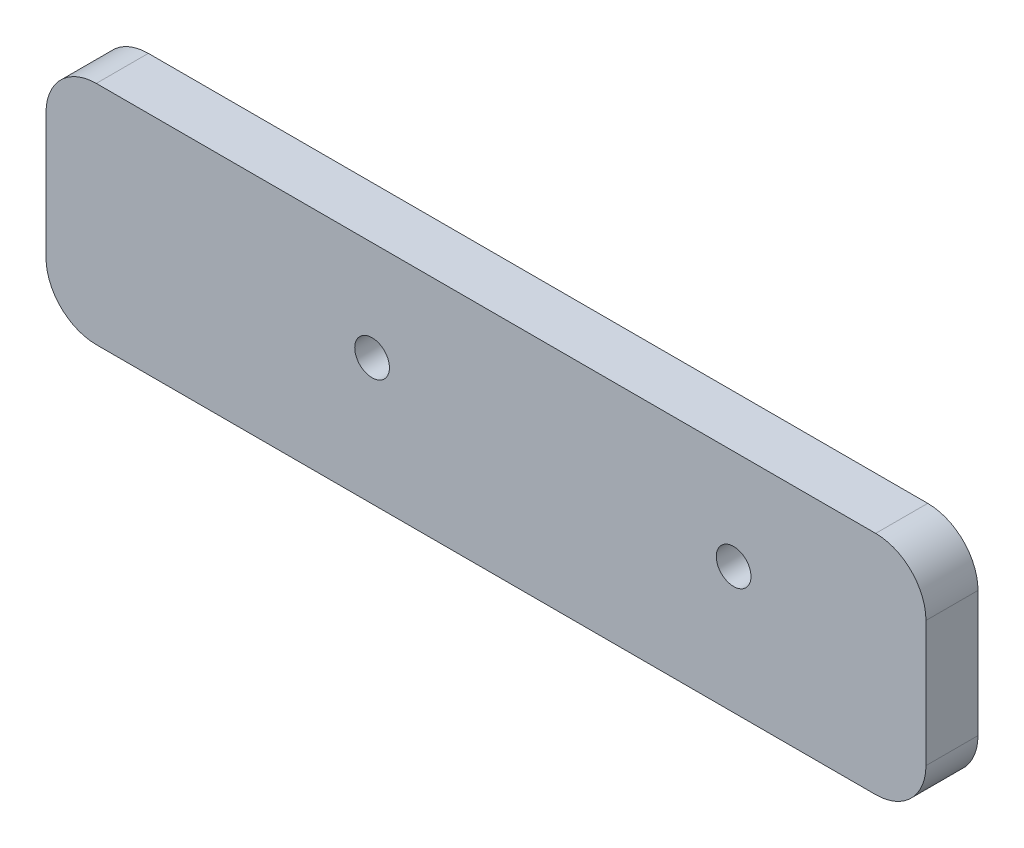
ISO-10303-21;
HEADER;
FILE_DESCRIPTION(('STEP AP214'),'2;1');
FILE_NAME('part.step','',(''),(''),'','','');
FILE_SCHEMA(('AUTOMOTIVE_DESIGN { 1 0 10303 214 1 1 1 1 }'));
ENDSEC;
DATA;
#1=APPLICATION_CONTEXT('core data for automotive mechanical design processes');
#2=APPLICATION_PROTOCOL_DEFINITION('international standard','automotive_design',2000,#1);
#3=PRODUCT_CONTEXT('',#1,'mechanical');
#4=PRODUCT('Part','Part','',(#3));
#5=PRODUCT_RELATED_PRODUCT_CATEGORY('part','',(#4));
#6=PRODUCT_DEFINITION_FORMATION('','',#4);
#7=PRODUCT_DEFINITION_CONTEXT('part definition',#1,'design');
#8=PRODUCT_DEFINITION('design','',#6,#7);
#9=PRODUCT_DEFINITION_SHAPE('','',#8);
#10=(LENGTH_UNIT() NAMED_UNIT(*) SI_UNIT(.MILLI.,.METRE.));
#11=(NAMED_UNIT(*) PLANE_ANGLE_UNIT() SI_UNIT($,.RADIAN.));
#12=(NAMED_UNIT(*) SI_UNIT($,.STERADIAN.) SOLID_ANGLE_UNIT());
#13=UNCERTAINTY_MEASURE_WITH_UNIT(LENGTH_MEASURE(1.E-05),#10,'distance_accuracy_value','');
#14=(GEOMETRIC_REPRESENTATION_CONTEXT(3) GLOBAL_UNCERTAINTY_ASSIGNED_CONTEXT((#13)) GLOBAL_UNIT_ASSIGNED_CONTEXT((#10,
#11,#12)) REPRESENTATION_CONTEXT('',''));
#15=CARTESIAN_POINT('',(0.,0.,0.));
#16=DIRECTION('',(0.,0.,1.));
#17=DIRECTION('',(1.,0.,0.));
#18=AXIS2_PLACEMENT_3D('',#15,#16,#17);
#19=CARTESIAN_POINT('',(-39.37,-6.35,5.2578));
#20=DIRECTION('',(0.,0.,1.));
#21=DIRECTION('',(1.,0.,0.));
#22=AXIS2_PLACEMENT_3D('',#19,#20,#21);
#23=CYLINDRICAL_SURFACE('',#22,5.08);
#24=DIRECTION('',(0.,0.,1.));
#25=VECTOR('',#24,1.);
#26=CARTESIAN_POINT('',(-44.45,-6.35,5.2578));
#27=LINE('',#26,#25);
#28=CARTESIAN_POINT('',(-44.45,-6.35,0.));
#29=VERTEX_POINT('',#28);
#30=CARTESIAN_POINT('',(-44.45,-6.35,5.2578));
#31=VERTEX_POINT('',#30);
#32=EDGE_CURVE('E152',#29,#31,#27,.T.);
#33=ORIENTED_EDGE('',*,*,#32,.F.);
#34=CARTESIAN_POINT('',(-39.37,-6.35,0.));
#35=DIRECTION('',(0.,0.,-1.));
#36=DIRECTION('',(-1.,0.,0.));
#37=AXIS2_PLACEMENT_3D('',#34,#35,#36);
#38=CIRCLE('',#37,5.08);
#39=CARTESIAN_POINT('',(-39.37,-11.43,0.));
#40=VERTEX_POINT('',#39);
#41=EDGE_CURVE('E41',#40,#29,#38,.T.);
#42=ORIENTED_EDGE('',*,*,#41,.F.);
#43=DIRECTION('',(0.,0.,1.));
#44=VECTOR('',#43,1.);
#45=CARTESIAN_POINT('',(-39.37,-11.43,5.2578));
#46=LINE('',#45,#44);
#47=CARTESIAN_POINT('',(-39.37,-11.43,5.2578));
#48=VERTEX_POINT('',#47);
#49=EDGE_CURVE('E155',#48,#40,#46,.F.);
#50=ORIENTED_EDGE('',*,*,#49,.F.);
#51=CARTESIAN_POINT('',(-39.37,-6.35,5.2578));
#52=DIRECTION('',(0.,0.,-1.));
#53=DIRECTION('',(-1.,0.,0.));
#54=AXIS2_PLACEMENT_3D('',#51,#52,#53);
#55=CIRCLE('',#54,5.08);
#56=EDGE_CURVE('E11',#31,#48,#55,.F.);
#57=ORIENTED_EDGE('',*,*,#56,.F.);
#58=EDGE_LOOP('',(#33,#42,#50,#57));
#59=FACE_BOUND('',#58,.T.);
#60=ADVANCED_FACE('F33',(#59),#23,.T.);
#61=CARTESIAN_POINT('',(39.37,-6.35,5.2578));
#62=DIRECTION('',(0.,0.,-1.));
#63=DIRECTION('',(-1.,0.,0.));
#64=AXIS2_PLACEMENT_3D('',#61,#62,#63);
#65=CYLINDRICAL_SURFACE('',#64,5.08);
#66=DIRECTION('',(0.,0.,-1.));
#67=VECTOR('',#66,1.);
#68=CARTESIAN_POINT('',(44.45,-6.35,5.2578));
#69=LINE('',#68,#67);
#70=CARTESIAN_POINT('',(44.45,-6.35,5.2578));
#71=VERTEX_POINT('',#70);
#72=CARTESIAN_POINT('',(44.45,-6.35,0.));
#73=VERTEX_POINT('',#72);
#74=EDGE_CURVE('E141',#71,#73,#69,.T.);
#75=ORIENTED_EDGE('',*,*,#74,.F.);
#76=CARTESIAN_POINT('',(39.37,-6.35,5.2578));
#77=DIRECTION('',(0.,0.,-1.));
#78=DIRECTION('',(-1.,0.,0.));
#79=AXIS2_PLACEMENT_3D('',#76,#77,#78);
#80=CIRCLE('',#79,5.08);
#81=CARTESIAN_POINT('',(39.37,-11.43,5.2578));
#82=VERTEX_POINT('',#81);
#83=EDGE_CURVE('E147',#82,#71,#80,.F.);
#84=ORIENTED_EDGE('',*,*,#83,.F.);
#85=DIRECTION('',(0.,0.,-1.));
#86=VECTOR('',#85,1.);
#87=CARTESIAN_POINT('',(39.37,-11.43,5.2578));
#88=LINE('',#87,#86);
#89=CARTESIAN_POINT('',(39.37,-11.43,0.));
#90=VERTEX_POINT('',#89);
#91=EDGE_CURVE('E144',#90,#82,#88,.F.);
#92=ORIENTED_EDGE('',*,*,#91,.F.);
#93=CARTESIAN_POINT('',(39.37,-6.35,0.));
#94=DIRECTION('',(0.,0.,-1.));
#95=DIRECTION('',(-1.,0.,0.));
#96=AXIS2_PLACEMENT_3D('',#93,#94,#95);
#97=CIRCLE('',#96,5.08);
#98=EDGE_CURVE('E149',#73,#90,#97,.T.);
#99=ORIENTED_EDGE('',*,*,#98,.F.);
#100=EDGE_LOOP('',(#75,#84,#92,#99));
#101=FACE_BOUND('',#100,.T.);
#102=ADVANCED_FACE('F184',(#101),#65,.T.);
#103=CARTESIAN_POINT('',(39.37,6.35,5.2578));
#104=DIRECTION('',(0.,0.,-1.));
#105=DIRECTION('',(-1.,0.,0.));
#106=AXIS2_PLACEMENT_3D('',#103,#104,#105);
#107=CYLINDRICAL_SURFACE('',#106,5.08);
#108=DIRECTION('',(0.,0.,-1.));
#109=VECTOR('',#108,1.);
#110=CARTESIAN_POINT('',(39.37,11.43,5.2578));
#111=LINE('',#110,#109);
#112=CARTESIAN_POINT('',(39.37,11.43,5.2578));
#113=VERTEX_POINT('',#112);
#114=CARTESIAN_POINT('',(39.37,11.43,0.));
#115=VERTEX_POINT('',#114);
#116=EDGE_CURVE('E104',#113,#115,#111,.T.);
#117=ORIENTED_EDGE('',*,*,#116,.F.);
#118=CARTESIAN_POINT('',(39.37,6.35,5.2578));
#119=DIRECTION('',(0.,0.,-1.));
#120=DIRECTION('',(-1.,0.,0.));
#121=AXIS2_PLACEMENT_3D('',#118,#119,#120);
#122=CIRCLE('',#121,5.08);
#123=CARTESIAN_POINT('',(44.45,6.35,5.2578));
#124=VERTEX_POINT('',#123);
#125=EDGE_CURVE('E137',#124,#113,#122,.F.);
#126=ORIENTED_EDGE('',*,*,#125,.F.);
#127=DIRECTION('',(0.,0.,-1.));
#128=VECTOR('',#127,1.);
#129=CARTESIAN_POINT('',(44.45,6.35,5.2578));
#130=LINE('',#129,#128);
#131=CARTESIAN_POINT('',(44.45,6.35,0.));
#132=VERTEX_POINT('',#131);
#133=EDGE_CURVE('E134',#132,#124,#130,.F.);
#134=ORIENTED_EDGE('',*,*,#133,.F.);
#135=CARTESIAN_POINT('',(39.37,6.35,0.));
#136=DIRECTION('',(0.,0.,-1.));
#137=DIRECTION('',(-1.,0.,0.));
#138=AXIS2_PLACEMENT_3D('',#135,#136,#137);
#139=CIRCLE('',#138,5.08);
#140=EDGE_CURVE('E139',#115,#132,#139,.T.);
#141=ORIENTED_EDGE('',*,*,#140,.F.);
#142=EDGE_LOOP('',(#117,#126,#134,#141));
#143=FACE_BOUND('',#142,.T.);
#144=ADVANCED_FACE('F192',(#143),#107,.T.);
#145=CARTESIAN_POINT('',(-39.37,6.35,5.2578));
#146=DIRECTION('',(0.,0.,1.));
#147=DIRECTION('',(1.,0.,0.));
#148=AXIS2_PLACEMENT_3D('',#145,#146,#147);
#149=CYLINDRICAL_SURFACE('',#148,5.08);
#150=DIRECTION('',(0.,0.,1.));
#151=VECTOR('',#150,1.);
#152=CARTESIAN_POINT('',(-39.37,11.43,5.2578));
#153=LINE('',#152,#151);
#154=CARTESIAN_POINT('',(-39.37,11.43,0.));
#155=VERTEX_POINT('',#154);
#156=CARTESIAN_POINT('',(-39.37,11.43,5.2578));
#157=VERTEX_POINT('',#156);
#158=EDGE_CURVE('E102',#155,#157,#153,.T.);
#159=ORIENTED_EDGE('',*,*,#158,.F.);
#160=CARTESIAN_POINT('',(-39.37,6.35,0.));
#161=DIRECTION('',(0.,0.,-1.));
#162=DIRECTION('',(-1.,0.,0.));
#163=AXIS2_PLACEMENT_3D('',#160,#161,#162);
#164=CIRCLE('',#163,5.08);
#165=CARTESIAN_POINT('',(-44.45,6.35,0.));
#166=VERTEX_POINT('',#165);
#167=EDGE_CURVE('E111',#166,#155,#164,.T.);
#168=ORIENTED_EDGE('',*,*,#167,.F.);
#169=DIRECTION('',(0.,0.,1.));
#170=VECTOR('',#169,1.);
#171=CARTESIAN_POINT('',(-44.45,6.35,5.2578));
#172=LINE('',#171,#170);
#173=CARTESIAN_POINT('',(-44.45,6.35,5.2578));
#174=VERTEX_POINT('',#173);
#175=EDGE_CURVE('E119',#174,#166,#172,.F.);
#176=ORIENTED_EDGE('',*,*,#175,.F.);
#177=CARTESIAN_POINT('',(-39.37,6.35,5.2578));
#178=DIRECTION('',(0.,0.,-1.));
#179=DIRECTION('',(-1.,0.,0.));
#180=AXIS2_PLACEMENT_3D('',#177,#178,#179);
#181=CIRCLE('',#180,5.08);
#182=EDGE_CURVE('E118',#157,#174,#181,.F.);
#183=ORIENTED_EDGE('',*,*,#182,.F.);
#184=EDGE_LOOP('',(#159,#168,#176,#183));
#185=FACE_BOUND('',#184,.T.);
#186=ADVANCED_FACE('F122',(#185),#149,.T.);
#187=CARTESIAN_POINT('',(44.45,-11.43,5.2578));
#188=DIRECTION('',(-1.,0.,0.));
#189=DIRECTION('',(0.,0.,1.));
#190=AXIS2_PLACEMENT_3D('',#187,#188,#189);
#191=PLANE('',#190);
#192=DIRECTION('',(0.,1.,0.));
#193=VECTOR('',#192,1.);
#194=CARTESIAN_POINT('',(44.45,-11.43,5.2578));
#195=LINE('',#194,#193);
#196=EDGE_CURVE('E171',#71,#124,#195,.T.);
#197=ORIENTED_EDGE('',*,*,#196,.F.);
#198=ORIENTED_EDGE('',*,*,#74,.T.);
#199=DIRECTION('',(0.,1.,0.));
#200=VECTOR('',#199,1.);
#201=CARTESIAN_POINT('',(44.45,-11.43,0.));
#202=LINE('',#201,#200);
#203=EDGE_CURVE('E108',#73,#132,#202,.T.);
#204=ORIENTED_EDGE('',*,*,#203,.T.);
#205=ORIENTED_EDGE('',*,*,#133,.T.);
#206=EDGE_LOOP('',(#197,#198,#204,#205));
#207=FACE_BOUND('',#206,.T.);
#208=ADVANCED_FACE('F193',(#207),#191,.F.);
#209=CARTESIAN_POINT('',(-44.45,11.43,5.2578));
#210=DIRECTION('',(0.,-1.,0.));
#211=DIRECTION('',(0.,0.,-1.));
#212=AXIS2_PLACEMENT_3D('',#209,#210,#211);
#213=PLANE('',#212);
#214=DIRECTION('',(-1.,0.,0.));
#215=VECTOR('',#214,1.);
#216=CARTESIAN_POINT('',(-44.45,11.43,5.2578));
#217=LINE('',#216,#215);
#218=EDGE_CURVE('E173',#113,#157,#217,.T.);
#219=ORIENTED_EDGE('',*,*,#218,.F.);
#220=ORIENTED_EDGE('',*,*,#116,.T.);
#221=DIRECTION('',(-1.,0.,0.));
#222=VECTOR('',#221,1.);
#223=CARTESIAN_POINT('',(-44.45,11.43,0.));
#224=LINE('',#223,#222);
#225=EDGE_CURVE('E97',#115,#155,#224,.T.);
#226=ORIENTED_EDGE('',*,*,#225,.T.);
#227=ORIENTED_EDGE('',*,*,#158,.T.);
#228=EDGE_LOOP('',(#219,#220,#226,#227));
#229=FACE_BOUND('',#228,.T.);
#230=ADVANCED_FACE('F100',(#229),#213,.F.);
#231=CARTESIAN_POINT('',(-44.45,-11.43,5.2578));
#232=DIRECTION('',(1.,0.,0.));
#233=DIRECTION('',(0.,0.,-1.));
#234=AXIS2_PLACEMENT_3D('',#231,#232,#233);
#235=PLANE('',#234);
#236=DIRECTION('',(0.,-1.,0.));
#237=VECTOR('',#236,1.);
#238=CARTESIAN_POINT('',(-44.45,-11.43,0.));
#239=LINE('',#238,#237);
#240=EDGE_CURVE('E107',#166,#29,#239,.T.);
#241=ORIENTED_EDGE('',*,*,#240,.T.);
#242=ORIENTED_EDGE('',*,*,#32,.T.);
#243=DIRECTION('',(0.,-1.,0.));
#244=VECTOR('',#243,1.);
#245=CARTESIAN_POINT('',(-44.45,-11.43,5.2578));
#246=LINE('',#245,#244);
#247=EDGE_CURVE('E126',#174,#31,#246,.T.);
#248=ORIENTED_EDGE('',*,*,#247,.F.);
#249=ORIENTED_EDGE('',*,*,#175,.T.);
#250=EDGE_LOOP('',(#241,#242,#248,#249));
#251=FACE_BOUND('',#250,.T.);
#252=ADVANCED_FACE('F200',(#251),#235,.F.);
#253=CARTESIAN_POINT('',(-44.45,-11.43,5.2578));
#254=DIRECTION('',(0.,1.,0.));
#255=DIRECTION('',(0.,0.,1.));
#256=AXIS2_PLACEMENT_3D('',#253,#254,#255);
#257=PLANE('',#256);
#258=DIRECTION('',(1.,0.,0.));
#259=VECTOR('',#258,1.);
#260=CARTESIAN_POINT('',(-44.45,-11.43,5.2578));
#261=LINE('',#260,#259);
#262=EDGE_CURVE('E123',#48,#82,#261,.T.);
#263=ORIENTED_EDGE('',*,*,#262,.F.);
#264=ORIENTED_EDGE('',*,*,#49,.T.);
#265=DIRECTION('',(1.,0.,0.));
#266=VECTOR('',#265,1.);
#267=CARTESIAN_POINT('',(-44.45,-11.43,0.));
#268=LINE('',#267,#266);
#269=EDGE_CURVE('E129',#40,#90,#268,.T.);
#270=ORIENTED_EDGE('',*,*,#269,.T.);
#271=ORIENTED_EDGE('',*,*,#91,.T.);
#272=EDGE_LOOP('',(#263,#264,#270,#271));
#273=FACE_BOUND('',#272,.T.);
#274=ADVANCED_FACE('F178',(#273),#257,.F.);
#275=CARTESIAN_POINT('',(44.45,11.43,5.2578));
#276=DIRECTION('',(0.,0.,-1.));
#277=DIRECTION('',(-1.,0.,0.));
#278=AXIS2_PLACEMENT_3D('',#275,#276,#277);
#279=PLANE('',#278);
#280=ORIENTED_EDGE('',*,*,#247,.T.);
#281=ORIENTED_EDGE('',*,*,#56,.T.);
#282=ORIENTED_EDGE('',*,*,#262,.T.);
#283=ORIENTED_EDGE('',*,*,#83,.T.);
#284=ORIENTED_EDGE('',*,*,#196,.T.);
#285=ORIENTED_EDGE('',*,*,#125,.T.);
#286=ORIENTED_EDGE('',*,*,#218,.T.);
#287=ORIENTED_EDGE('',*,*,#182,.T.);
#288=EDGE_LOOP('',(#280,#281,#282,#283,#284,#285,#286,#287));
#289=FACE_BOUND('',#288,.T.);
#290=CARTESIAN_POINT('',(25.019,1.35889999999996,5.25780000000001));
#291=DIRECTION('',(0.,0.,1.));
#292=DIRECTION('',(-0.725995793369595,-0.687699140620121,0.));
#293=AXIS2_PLACEMENT_3D('',#290,#291,#292);
#294=CIRCLE('',#293,1.7526);
#295=CARTESIAN_POINT('',(23.7466197725404,0.153638486149134,5.25780000000001));
#296=VERTEX_POINT('',#295);
#297=EDGE_CURVE('E159',#296,#296,#294,.T.);
#298=ORIENTED_EDGE('',*,*,#297,.F.);
#299=EDGE_LOOP('',(#298));
#300=FACE_BOUND('',#299,.T.);
#301=CARTESIAN_POINT('',(-11.5062,1.35889999999996,5.25780000000001));
#302=DIRECTION('',(0.,0.,1.));
#303=DIRECTION('',(0.980819416592038,0.194918629268871,0.));
#304=AXIS2_PLACEMENT_3D('',#301,#302,#303);
#305=CIRCLE('',#304,1.7526);
#306=CARTESIAN_POINT('',(-9.78721589048082,1.70051438965658,5.25780000000001));
#307=VERTEX_POINT('',#306);
#308=EDGE_CURVE('E168',#307,#307,#305,.T.);
#309=ORIENTED_EDGE('',*,*,#308,.F.);
#310=EDGE_LOOP('',(#309));
#311=FACE_BOUND('',#310,.T.);
#312=ADVANCED_FACE('F186',(#289,#300,#311),#279,.F.);
#313=CARTESIAN_POINT('',(44.45,11.43,0.));
#314=DIRECTION('',(0.,0.,-1.));
#315=DIRECTION('',(-1.,0.,0.));
#316=AXIS2_PLACEMENT_3D('',#313,#314,#315);
#317=PLANE('',#316);
#318=CARTESIAN_POINT('',(-11.5062,1.35889999999996,0.));
#319=DIRECTION('',(0.,0.,-1.));
#320=DIRECTION('',(-1.,0.,0.));
#321=AXIS2_PLACEMENT_3D('',#318,#319,#320);
#322=CIRCLE('',#321,1.7526);
#323=CARTESIAN_POINT('',(-13.2588,1.35889999999996,0.));
#324=VERTEX_POINT('',#323);
#325=EDGE_CURVE('E36',#324,#324,#322,.T.);
#326=ORIENTED_EDGE('',*,*,#325,.F.);
#327=EDGE_LOOP('',(#326));
#328=FACE_BOUND('',#327,.T.);
#329=CARTESIAN_POINT('',(25.019,1.35889999999996,0.));
#330=DIRECTION('',(0.,0.,-1.));
#331=DIRECTION('',(-1.,0.,0.));
#332=AXIS2_PLACEMENT_3D('',#329,#330,#331);
#333=CIRCLE('',#332,1.7526);
#334=CARTESIAN_POINT('',(23.2664,1.35889999999996,0.));
#335=VERTEX_POINT('',#334);
#336=EDGE_CURVE('E157',#335,#335,#333,.T.);
#337=ORIENTED_EDGE('',*,*,#336,.F.);
#338=EDGE_LOOP('',(#337));
#339=FACE_BOUND('',#338,.T.);
#340=ORIENTED_EDGE('',*,*,#269,.F.);
#341=ORIENTED_EDGE('',*,*,#41,.T.);
#342=ORIENTED_EDGE('',*,*,#240,.F.);
#343=ORIENTED_EDGE('',*,*,#167,.T.);
#344=ORIENTED_EDGE('',*,*,#225,.F.);
#345=ORIENTED_EDGE('',*,*,#140,.T.);
#346=ORIENTED_EDGE('',*,*,#203,.F.);
#347=ORIENTED_EDGE('',*,*,#98,.T.);
#348=EDGE_LOOP('',(#340,#341,#342,#343,#344,#345,#346,#347));
#349=FACE_BOUND('',#348,.T.);
#350=ADVANCED_FACE('F113',(#328,#339,#349),#317,.T.);
#351=CARTESIAN_POINT('',(25.019,1.35889999999996,33.655));
#352=DIRECTION('',(0.,0.,1.));
#353=DIRECTION('',(-0.725995793369595,-0.687699140620121,0.));
#354=AXIS2_PLACEMENT_3D('',#351,#352,#353);
#355=CYLINDRICAL_SURFACE('',#354,1.7526);
#356=ORIENTED_EDGE('',*,*,#336,.T.);
#357=EDGE_LOOP('',(#356));
#358=FACE_BOUND('',#357,.T.);
#359=ORIENTED_EDGE('',*,*,#297,.T.);
#360=EDGE_LOOP('',(#359));
#361=FACE_BOUND('',#360,.T.);
#362=ADVANCED_FACE('F217',(#358,#361),#355,.F.);
#363=CARTESIAN_POINT('',(-11.5062,1.35889999999996,33.655));
#364=DIRECTION('',(0.,0.,1.));
#365=DIRECTION('',(0.980819416592038,0.194918629268871,0.));
#366=AXIS2_PLACEMENT_3D('',#363,#364,#365);
#367=CYLINDRICAL_SURFACE('',#366,1.7526);
#368=ORIENTED_EDGE('',*,*,#325,.T.);
#369=EDGE_LOOP('',(#368));
#370=FACE_BOUND('',#369,.T.);
#371=ORIENTED_EDGE('',*,*,#308,.T.);
#372=EDGE_LOOP('',(#371));
#373=FACE_BOUND('',#372,.T.);
#374=ADVANCED_FACE('F223',(#370,#373),#367,.F.);
#375=CLOSED_SHELL('',(#60,#102,#144,#186,#208,#230,#252,#274,#312,#350,#362,#374));
#376=MANIFOLD_SOLID_BREP('B2',#375);
#377=ADVANCED_BREP_SHAPE_REPRESENTATION('',(#18,#376),#14);
#378=SHAPE_DEFINITION_REPRESENTATION(#9,#377);
ENDSEC;
END-ISO-10303-21;
